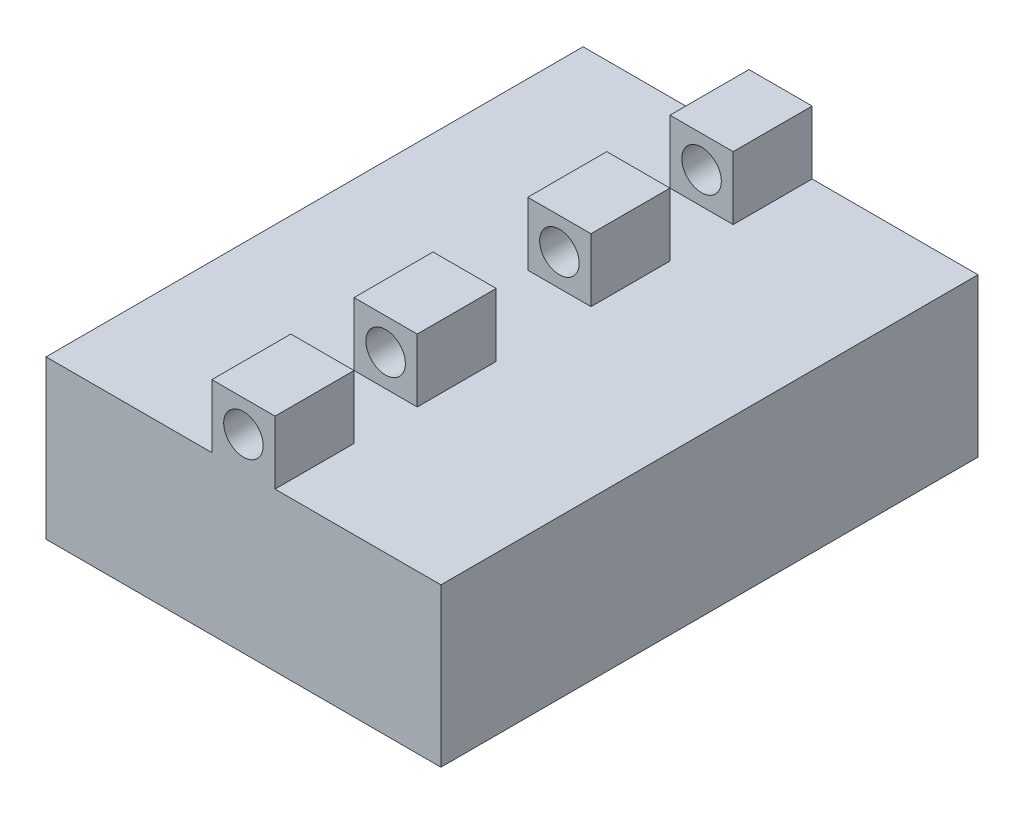
ISO-10303-21;
HEADER;
FILE_DESCRIPTION(('STEP AP214'),'2;1');
FILE_NAME('part.step','',(''),(''),'','','');
FILE_SCHEMA(('AUTOMOTIVE_DESIGN { 1 0 10303 214 1 1 1 1 }'));
ENDSEC;
DATA;
#1=APPLICATION_CONTEXT('core data for automotive mechanical design processes');
#2=APPLICATION_PROTOCOL_DEFINITION('international standard','automotive_design',2000,#1);
#3=PRODUCT_CONTEXT('',#1,'mechanical');
#4=PRODUCT('Part','Part','',(#3));
#5=PRODUCT_RELATED_PRODUCT_CATEGORY('part','',(#4));
#6=PRODUCT_DEFINITION_FORMATION('','',#4);
#7=PRODUCT_DEFINITION_CONTEXT('part definition',#1,'design');
#8=PRODUCT_DEFINITION('design','',#6,#7);
#9=PRODUCT_DEFINITION_SHAPE('','',#8);
#10=(LENGTH_UNIT() NAMED_UNIT(*) SI_UNIT(.MILLI.,.METRE.));
#11=(NAMED_UNIT(*) PLANE_ANGLE_UNIT() SI_UNIT($,.RADIAN.));
#12=(NAMED_UNIT(*) SI_UNIT($,.STERADIAN.) SOLID_ANGLE_UNIT());
#13=UNCERTAINTY_MEASURE_WITH_UNIT(LENGTH_MEASURE(1.E-05),#10,'distance_accuracy_value','');
#14=(GEOMETRIC_REPRESENTATION_CONTEXT(3) GLOBAL_UNCERTAINTY_ASSIGNED_CONTEXT((#13)) GLOBAL_UNIT_ASSIGNED_CONTEXT((#10,
#11,#12)) REPRESENTATION_CONTEXT('',''));
#15=CARTESIAN_POINT('',(0.,0.,0.));
#16=DIRECTION('',(0.,0.,1.));
#17=DIRECTION('',(1.,0.,0.));
#18=AXIS2_PLACEMENT_3D('',#15,#16,#17);
#19=CARTESIAN_POINT('',(145.,120.,0.));
#20=DIRECTION('',(1.,0.,0.));
#21=DIRECTION('',(0.,0.,-1.));
#22=AXIS2_PLACEMENT_3D('',#19,#20,#21);
#23=PLANE('',#22);
#24=DIRECTION('',(0.,1.,0.));
#25=VECTOR('',#24,1.);
#26=CARTESIAN_POINT('',(145.,100.,250.));
#27=LINE('',#26,#25);
#28=CARTESIAN_POINT('',(145.,100.,250.));
#29=VERTEX_POINT('',#28);
#30=CARTESIAN_POINT('',(145.,140.,250.));
#31=VERTEX_POINT('',#30);
#32=EDGE_CURVE('E343',#29,#31,#27,.T.);
#33=ORIENTED_EDGE('',*,*,#32,.F.);
#34=DIRECTION('',(0.,0.,1.));
#35=VECTOR('',#34,1.);
#36=CARTESIAN_POINT('',(145.,100.,0.));
#37=LINE('',#36,#35);
#38=CARTESIAN_POINT('',(145.,100.,200.));
#39=VERTEX_POINT('',#38);
#40=EDGE_CURVE('E223',#39,#29,#37,.T.);
#41=ORIENTED_EDGE('',*,*,#40,.F.);
#42=DIRECTION('',(0.,1.,0.));
#43=VECTOR('',#42,1.);
#44=CARTESIAN_POINT('',(145.,100.,200.));
#45=LINE('',#44,#43);
#46=CARTESIAN_POINT('',(145.,140.,200.));
#47=VERTEX_POINT('',#46);
#48=EDGE_CURVE('E250',#39,#47,#45,.T.);
#49=ORIENTED_EDGE('',*,*,#48,.T.);
#50=DIRECTION('',(0.,0.,1.));
#51=VECTOR('',#50,1.);
#52=CARTESIAN_POINT('',(145.,140.,0.));
#53=LINE('',#52,#51);
#54=EDGE_CURVE('E344',#47,#31,#53,.T.);
#55=ORIENTED_EDGE('',*,*,#54,.T.);
#56=EDGE_LOOP('',(#33,#41,#49,#55));
#57=FACE_BOUND('',#56,.T.);
#58=ADVANCED_FACE('F39',(#57),#23,.T.);
#59=DIRECTION('',(0.,1.,0.));
#60=VECTOR('',#59,1.);
#61=CARTESIAN_POINT('',(145.,100.,140.));
#62=LINE('',#61,#60);
#63=CARTESIAN_POINT('',(145.,100.,140.));
#64=VERTEX_POINT('',#63);
#65=CARTESIAN_POINT('',(145.,140.,140.));
#66=VERTEX_POINT('',#65);
#67=EDGE_CURVE('E265',#64,#66,#62,.T.);
#68=ORIENTED_EDGE('',*,*,#67,.F.);
#69=CARTESIAN_POINT('',(145.,100.,90.));
#70=VERTEX_POINT('',#69);
#71=EDGE_CURVE('E242',#70,#64,#37,.T.);
#72=ORIENTED_EDGE('',*,*,#71,.F.);
#73=DIRECTION('',(0.,1.,0.));
#74=VECTOR('',#73,1.);
#75=CARTESIAN_POINT('',(145.,100.,90.));
#76=LINE('',#75,#74);
#77=CARTESIAN_POINT('',(145.,140.,90.));
#78=VERTEX_POINT('',#77);
#79=EDGE_CURVE('E288',#70,#78,#76,.T.);
#80=ORIENTED_EDGE('',*,*,#79,.T.);
#81=EDGE_CURVE('E373',#78,#66,#53,.T.);
#82=ORIENTED_EDGE('',*,*,#81,.T.);
#83=EDGE_LOOP('',(#68,#72,#80,#82));
#84=FACE_BOUND('',#83,.T.);
#85=ADVANCED_FACE('F386',(#84),#23,.T.);
#86=DIRECTION('',(0.,1.,0.));
#87=VECTOR('',#86,1.);
#88=CARTESIAN_POINT('',(145.,100.,50.));
#89=LINE('',#88,#87);
#90=CARTESIAN_POINT('',(145.,100.,50.));
#91=VERTEX_POINT('',#90);
#92=CARTESIAN_POINT('',(145.,140.,50.));
#93=VERTEX_POINT('',#92);
#94=EDGE_CURVE('E285',#91,#93,#89,.T.);
#95=ORIENTED_EDGE('',*,*,#94,.F.);
#96=CARTESIAN_POINT('',(145.,100.,0.));
#97=VERTEX_POINT('',#96);
#98=EDGE_CURVE('E224',#97,#91,#37,.T.);
#99=ORIENTED_EDGE('',*,*,#98,.F.);
#100=DIRECTION('',(0.,1.,0.));
#101=VECTOR('',#100,1.);
#102=CARTESIAN_POINT('',(145.,132.5,0.));
#103=LINE('',#102,#101);
#104=CARTESIAN_POINT('',(145.,140.,0.));
#105=VERTEX_POINT('',#104);
#106=EDGE_CURVE('E303',#97,#105,#103,.T.);
#107=ORIENTED_EDGE('',*,*,#106,.T.);
#108=EDGE_CURVE('E371',#105,#93,#53,.T.);
#109=ORIENTED_EDGE('',*,*,#108,.T.);
#110=EDGE_LOOP('',(#95,#99,#107,#109));
#111=FACE_BOUND('',#110,.T.);
#112=ADVANCED_FACE('F468',(#111),#23,.T.);
#113=CARTESIAN_POINT('',(105.,120.,0.));
#114=DIRECTION('',(-1.,0.,0.));
#115=DIRECTION('',(0.,0.,1.));
#116=AXIS2_PLACEMENT_3D('',#113,#114,#115);
#117=PLANE('',#116);
#118=DIRECTION('',(0.,1.,0.));
#119=VECTOR('',#118,1.);
#120=CARTESIAN_POINT('',(105.,100.,250.));
#121=LINE('',#120,#119);
#122=CARTESIAN_POINT('',(105.,100.,250.));
#123=VERTEX_POINT('',#122);
#124=CARTESIAN_POINT('',(105.,140.,250.));
#125=VERTEX_POINT('',#124);
#126=EDGE_CURVE('E348',#123,#125,#121,.T.);
#127=ORIENTED_EDGE('',*,*,#126,.T.);
#128=DIRECTION('',(0.,0.,1.));
#129=VECTOR('',#128,1.);
#130=CARTESIAN_POINT('',(105.,140.,0.));
#131=LINE('',#130,#129);
#132=CARTESIAN_POINT('',(105.,140.,200.));
#133=VERTEX_POINT('',#132);
#134=EDGE_CURVE('E382',#133,#125,#131,.T.);
#135=ORIENTED_EDGE('',*,*,#134,.F.);
#136=DIRECTION('',(0.,1.,0.));
#137=VECTOR('',#136,1.);
#138=CARTESIAN_POINT('',(105.,100.,200.));
#139=LINE('',#138,#137);
#140=CARTESIAN_POINT('',(105.,100.,200.));
#141=VERTEX_POINT('',#140);
#142=EDGE_CURVE('E65',#141,#133,#139,.T.);
#143=ORIENTED_EDGE('',*,*,#142,.F.);
#144=DIRECTION('',(0.,0.,1.));
#145=VECTOR('',#144,1.);
#146=CARTESIAN_POINT('',(105.,100.,0.));
#147=LINE('',#146,#145);
#148=EDGE_CURVE('E204',#141,#123,#147,.T.);
#149=ORIENTED_EDGE('',*,*,#148,.T.);
#150=EDGE_LOOP('',(#127,#135,#143,#149));
#151=FACE_BOUND('',#150,.T.);
#152=ADVANCED_FACE('F502',(#151),#117,.T.);
#153=DIRECTION('',(0.,1.,0.));
#154=VECTOR('',#153,1.);
#155=CARTESIAN_POINT('',(105.,100.,140.));
#156=LINE('',#155,#154);
#157=CARTESIAN_POINT('',(105.,100.,140.));
#158=VERTEX_POINT('',#157);
#159=CARTESIAN_POINT('',(105.,140.,140.));
#160=VERTEX_POINT('',#159);
#161=EDGE_CURVE('E232',#158,#160,#156,.T.);
#162=ORIENTED_EDGE('',*,*,#161,.T.);
#163=CARTESIAN_POINT('',(105.,140.,90.));
#164=VERTEX_POINT('',#163);
#165=EDGE_CURVE('E213',#164,#160,#131,.T.);
#166=ORIENTED_EDGE('',*,*,#165,.F.);
#167=DIRECTION('',(0.,1.,0.));
#168=VECTOR('',#167,1.);
#169=CARTESIAN_POINT('',(105.,100.,90.));
#170=LINE('',#169,#168);
#171=CARTESIAN_POINT('',(105.,100.,90.));
#172=VERTEX_POINT('',#171);
#173=EDGE_CURVE('E234',#172,#164,#170,.T.);
#174=ORIENTED_EDGE('',*,*,#173,.F.);
#175=EDGE_CURVE('E211',#172,#158,#147,.T.);
#176=ORIENTED_EDGE('',*,*,#175,.T.);
#177=EDGE_LOOP('',(#162,#166,#174,#176));
#178=FACE_BOUND('',#177,.T.);
#179=ADVANCED_FACE('F230',(#178),#117,.T.);
#180=DIRECTION('',(0.,1.,0.));
#181=VECTOR('',#180,1.);
#182=CARTESIAN_POINT('',(105.,100.,50.));
#183=LINE('',#182,#181);
#184=CARTESIAN_POINT('',(105.,100.,50.));
#185=VERTEX_POINT('',#184);
#186=CARTESIAN_POINT('',(105.,140.,50.));
#187=VERTEX_POINT('',#186);
#188=EDGE_CURVE('E259',#185,#187,#183,.T.);
#189=ORIENTED_EDGE('',*,*,#188,.T.);
#190=CARTESIAN_POINT('',(105.,140.,0.));
#191=VERTEX_POINT('',#190);
#192=EDGE_CURVE('E205',#191,#187,#131,.T.);
#193=ORIENTED_EDGE('',*,*,#192,.F.);
#194=DIRECTION('',(0.,-1.,0.));
#195=VECTOR('',#194,1.);
#196=CARTESIAN_POINT('',(105.,140.,0.));
#197=LINE('',#196,#195);
#198=CARTESIAN_POINT('',(105.,100.,0.));
#199=VERTEX_POINT('',#198);
#200=EDGE_CURVE('E311',#191,#199,#197,.T.);
#201=ORIENTED_EDGE('',*,*,#200,.T.);
#202=EDGE_CURVE('E207',#199,#185,#147,.T.);
#203=ORIENTED_EDGE('',*,*,#202,.T.);
#204=EDGE_LOOP('',(#189,#193,#201,#203));
#205=FACE_BOUND('',#204,.T.);
#206=ADVANCED_FACE('F475',(#205),#117,.T.);
#207=CARTESIAN_POINT('',(145.,140.,0.));
#208=DIRECTION('',(0.,1.,0.));
#209=DIRECTION('',(0.,0.,1.));
#210=AXIS2_PLACEMENT_3D('',#207,#208,#209);
#211=PLANE('',#210);
#212=DIRECTION('',(-1.,0.,0.));
#213=VECTOR('',#212,1.);
#214=CARTESIAN_POINT('',(105.,140.,250.));
#215=LINE('',#214,#213);
#216=EDGE_CURVE('E187',#31,#125,#215,.T.);
#217=ORIENTED_EDGE('',*,*,#216,.F.);
#218=ORIENTED_EDGE('',*,*,#54,.F.);
#219=DIRECTION('',(1.,0.,0.));
#220=VECTOR('',#219,1.);
#221=CARTESIAN_POINT('',(105.,140.,200.));
#222=LINE('',#221,#220);
#223=EDGE_CURVE('E256',#133,#47,#222,.T.);
#224=ORIENTED_EDGE('',*,*,#223,.F.);
#225=ORIENTED_EDGE('',*,*,#134,.T.);
#226=EDGE_LOOP('',(#217,#218,#224,#225));
#227=FACE_BOUND('',#226,.T.);
#228=ADVANCED_FACE('F504',(#227),#211,.T.);
#229=DIRECTION('',(-1.,0.,0.));
#230=VECTOR('',#229,1.);
#231=CARTESIAN_POINT('',(105.,140.,140.));
#232=LINE('',#231,#230);
#233=EDGE_CURVE('E253',#66,#160,#232,.T.);
#234=ORIENTED_EDGE('',*,*,#233,.F.);
#235=ORIENTED_EDGE('',*,*,#81,.F.);
#236=DIRECTION('',(1.,0.,0.));
#237=VECTOR('',#236,1.);
#238=CARTESIAN_POINT('',(105.,140.,90.));
#239=LINE('',#238,#237);
#240=EDGE_CURVE('E278',#164,#78,#239,.T.);
#241=ORIENTED_EDGE('',*,*,#240,.F.);
#242=ORIENTED_EDGE('',*,*,#165,.T.);
#243=EDGE_LOOP('',(#234,#235,#241,#242));
#244=FACE_BOUND('',#243,.T.);
#245=ADVANCED_FACE('F390',(#244),#211,.T.);
#246=DIRECTION('',(-1.,0.,0.));
#247=VECTOR('',#246,1.);
#248=CARTESIAN_POINT('',(105.,140.,50.));
#249=LINE('',#248,#247);
#250=EDGE_CURVE('E274',#93,#187,#249,.T.);
#251=ORIENTED_EDGE('',*,*,#250,.F.);
#252=ORIENTED_EDGE('',*,*,#108,.F.);
#253=DIRECTION('',(-1.,0.,0.));
#254=VECTOR('',#253,1.);
#255=CARTESIAN_POINT('',(145.,140.,0.));
#256=LINE('',#255,#254);
#257=EDGE_CURVE('E306',#105,#191,#256,.T.);
#258=ORIENTED_EDGE('',*,*,#257,.T.);
#259=ORIENTED_EDGE('',*,*,#192,.T.);
#260=EDGE_LOOP('',(#251,#252,#258,#259));
#261=FACE_BOUND('',#260,.T.);
#262=ADVANCED_FACE('F474',(#261),#211,.T.);
#263=CARTESIAN_POINT('',(125.,120.,0.));
#264=DIRECTION('',(0.,0.,1.));
#265=DIRECTION('',(1.,0.,0.));
#266=AXIS2_PLACEMENT_3D('',#263,#264,#265);
#267=CYLINDRICAL_SURFACE('',#266,12.5);
#268=CARTESIAN_POINT('',(125.,120.,50.));
#269=DIRECTION('',(0.,0.,-1.));
#270=DIRECTION('',(-1.,0.,0.));
#271=AXIS2_PLACEMENT_3D('',#268,#269,#270);
#272=CIRCLE('',#271,12.5);
#273=CARTESIAN_POINT('',(112.5,120.,50.));
#274=VERTEX_POINT('',#273);
#275=EDGE_CURVE('E409',#274,#274,#272,.F.);
#276=ORIENTED_EDGE('',*,*,#275,.T.);
#277=EDGE_LOOP('',(#276));
#278=FACE_BOUND('',#277,.T.);
#279=CARTESIAN_POINT('',(125.,120.,0.));
#280=DIRECTION('',(0.,0.,1.));
#281=DIRECTION('',(1.,0.,0.));
#282=AXIS2_PLACEMENT_3D('',#279,#280,#281);
#283=CIRCLE('',#282,12.5);
#284=CARTESIAN_POINT('',(137.5,120.,0.));
#285=VERTEX_POINT('',#284);
#286=EDGE_CURVE('E294',#285,#285,#283,.T.);
#287=ORIENTED_EDGE('',*,*,#286,.F.);
#288=EDGE_LOOP('',(#287));
#289=FACE_BOUND('',#288,.T.);
#290=ADVANCED_FACE('F510',(#278,#289),#267,.F.);
#291=CARTESIAN_POINT('',(0.,100.,0.));
#292=DIRECTION('',(1.,0.,0.));
#293=DIRECTION('',(0.,0.,-1.));
#294=AXIS2_PLACEMENT_3D('',#291,#292,#293);
#295=PLANE('',#294);
#296=DIRECTION('',(0.,0.,1.));
#297=VECTOR('',#296,1.);
#298=CARTESIAN_POINT('',(0.,0.,0.));
#299=LINE('',#298,#297);
#300=CARTESIAN_POINT('',(0.,0.,0.));
#301=VERTEX_POINT('',#300);
#302=CARTESIAN_POINT('',(0.,0.,340.));
#303=VERTEX_POINT('',#302);
#304=EDGE_CURVE('E325',#301,#303,#299,.T.);
#305=ORIENTED_EDGE('',*,*,#304,.T.);
#306=DIRECTION('',(0.,-1.,0.));
#307=VECTOR('',#306,1.);
#308=CARTESIAN_POINT('',(0.,100.,340.));
#309=LINE('',#308,#307);
#310=CARTESIAN_POINT('',(0.,100.,340.));
#311=VERTEX_POINT('',#310);
#312=EDGE_CURVE('E11',#311,#303,#309,.T.);
#313=ORIENTED_EDGE('',*,*,#312,.F.);
#314=DIRECTION('',(0.,0.,1.));
#315=VECTOR('',#314,1.);
#316=CARTESIAN_POINT('',(0.,100.,0.));
#317=LINE('',#316,#315);
#318=CARTESIAN_POINT('',(0.,100.,0.));
#319=VERTEX_POINT('',#318);
#320=EDGE_CURVE('E433',#319,#311,#317,.T.);
#321=ORIENTED_EDGE('',*,*,#320,.F.);
#322=DIRECTION('',(0.,-1.,0.));
#323=VECTOR('',#322,1.);
#324=CARTESIAN_POINT('',(0.,100.,0.));
#325=LINE('',#324,#323);
#326=EDGE_CURVE('E425',#319,#301,#325,.T.);
#327=ORIENTED_EDGE('',*,*,#326,.T.);
#328=EDGE_LOOP('',(#305,#313,#321,#327));
#329=FACE_BOUND('',#328,.T.);
#330=ADVANCED_FACE('F41',(#329),#295,.F.);
#331=CARTESIAN_POINT('',(0.,100.,340.));
#332=DIRECTION('',(0.,0.,-1.));
#333=DIRECTION('',(-1.,0.,0.));
#334=AXIS2_PLACEMENT_3D('',#331,#332,#333);
#335=PLANE('',#334);
#336=DIRECTION('',(1.,0.,0.));
#337=VECTOR('',#336,1.);
#338=CARTESIAN_POINT('',(0.,0.,340.));
#339=LINE('',#338,#337);
#340=CARTESIAN_POINT('',(250.,0.,340.));
#341=VERTEX_POINT('',#340);
#342=EDGE_CURVE('E331',#303,#341,#339,.T.);
#343=ORIENTED_EDGE('',*,*,#342,.T.);
#344=DIRECTION('',(0.,-1.,0.));
#345=VECTOR('',#344,1.);
#346=CARTESIAN_POINT('',(250.,100.,340.));
#347=LINE('',#346,#345);
#348=CARTESIAN_POINT('',(250.,100.,340.));
#349=VERTEX_POINT('',#348);
#350=EDGE_CURVE('E49',#349,#341,#347,.T.);
#351=ORIENTED_EDGE('',*,*,#350,.F.);
#352=DIRECTION('',(1.,0.,0.));
#353=VECTOR('',#352,1.);
#354=CARTESIAN_POINT('',(0.,100.,340.));
#355=LINE('',#354,#353);
#356=CARTESIAN_POINT('',(145.,100.,340.));
#357=VERTEX_POINT('',#356);
#358=EDGE_CURVE('E446',#357,#349,#355,.T.);
#359=ORIENTED_EDGE('',*,*,#358,.F.);
#360=DIRECTION('',(0.,1.,0.));
#361=VECTOR('',#360,1.);
#362=CARTESIAN_POINT('',(145.,120.,340.));
#363=LINE('',#362,#361);
#364=CARTESIAN_POINT('',(145.,140.,340.));
#365=VERTEX_POINT('',#364);
#366=EDGE_CURVE('E307',#357,#365,#363,.T.);
#367=ORIENTED_EDGE('',*,*,#366,.T.);
#368=DIRECTION('',(-1.,0.,0.));
#369=VECTOR('',#368,1.);
#370=CARTESIAN_POINT('',(145.,140.,340.));
#371=LINE('',#370,#369);
#372=CARTESIAN_POINT('',(105.,140.,340.));
#373=VERTEX_POINT('',#372);
#374=EDGE_CURVE('E298',#365,#373,#371,.T.);
#375=ORIENTED_EDGE('',*,*,#374,.T.);
#376=DIRECTION('',(0.,-1.,0.));
#377=VECTOR('',#376,1.);
#378=CARTESIAN_POINT('',(105.,120.,340.));
#379=LINE('',#378,#377);
#380=CARTESIAN_POINT('',(105.,100.,340.));
#381=VERTEX_POINT('',#380);
#382=EDGE_CURVE('E318',#373,#381,#379,.T.);
#383=ORIENTED_EDGE('',*,*,#382,.T.);
#384=EDGE_CURVE('E202',#311,#381,#355,.T.);
#385=ORIENTED_EDGE('',*,*,#384,.F.);
#386=ORIENTED_EDGE('',*,*,#312,.T.);
#387=EDGE_LOOP('',(#343,#351,#359,#367,#375,#383,#385,#386));
#388=FACE_BOUND('',#387,.T.);
#389=CARTESIAN_POINT('',(125.,120.,340.));
#390=DIRECTION('',(0.,0.,1.));
#391=DIRECTION('',(1.,0.,0.));
#392=AXIS2_PLACEMENT_3D('',#389,#390,#391);
#393=CIRCLE('',#392,12.5);
#394=CARTESIAN_POINT('',(137.5,120.,340.));
#395=VERTEX_POINT('',#394);
#396=EDGE_CURVE('E299',#395,#395,#393,.T.);
#397=ORIENTED_EDGE('',*,*,#396,.F.);
#398=EDGE_LOOP('',(#397));
#399=FACE_BOUND('',#398,.T.);
#400=ADVANCED_FACE('F456',(#388,#399),#335,.F.);
#401=CARTESIAN_POINT('',(250.,100.,0.));
#402=DIRECTION('',(-1.,0.,0.));
#403=DIRECTION('',(0.,0.,1.));
#404=AXIS2_PLACEMENT_3D('',#401,#402,#403);
#405=PLANE('',#404);
#406=DIRECTION('',(0.,0.,-1.));
#407=VECTOR('',#406,1.);
#408=CARTESIAN_POINT('',(250.,0.,0.));
#409=LINE('',#408,#407);
#410=CARTESIAN_POINT('',(250.,0.,0.));
#411=VERTEX_POINT('',#410);
#412=EDGE_CURVE('E434',#341,#411,#409,.T.);
#413=ORIENTED_EDGE('',*,*,#412,.T.);
#414=DIRECTION('',(0.,-1.,0.));
#415=VECTOR('',#414,1.);
#416=CARTESIAN_POINT('',(250.,100.,0.));
#417=LINE('',#416,#415);
#418=CARTESIAN_POINT('',(250.,100.,0.));
#419=VERTEX_POINT('',#418);
#420=EDGE_CURVE('E421',#419,#411,#417,.T.);
#421=ORIENTED_EDGE('',*,*,#420,.F.);
#422=DIRECTION('',(0.,0.,-1.));
#423=VECTOR('',#422,1.);
#424=CARTESIAN_POINT('',(250.,100.,0.));
#425=LINE('',#424,#423);
#426=EDGE_CURVE('E442',#349,#419,#425,.T.);
#427=ORIENTED_EDGE('',*,*,#426,.F.);
#428=ORIENTED_EDGE('',*,*,#350,.T.);
#429=EDGE_LOOP('',(#413,#421,#427,#428));
#430=FACE_BOUND('',#429,.T.);
#431=ADVANCED_FACE('F460',(#430),#405,.F.);
#432=CARTESIAN_POINT('',(0.,100.,0.));
#433=DIRECTION('',(0.,0.,1.));
#434=DIRECTION('',(1.,0.,0.));
#435=AXIS2_PLACEMENT_3D('',#432,#433,#434);
#436=PLANE('',#435);
#437=DIRECTION('',(-1.,0.,0.));
#438=VECTOR('',#437,1.);
#439=CARTESIAN_POINT('',(0.,0.,0.));
#440=LINE('',#439,#438);
#441=EDGE_CURVE('E430',#411,#301,#440,.T.);
#442=ORIENTED_EDGE('',*,*,#441,.T.);
#443=ORIENTED_EDGE('',*,*,#326,.F.);
#444=DIRECTION('',(-1.,0.,0.));
#445=VECTOR('',#444,1.);
#446=CARTESIAN_POINT('',(0.,100.,0.));
#447=LINE('',#446,#445);
#448=EDGE_CURVE('E441',#199,#319,#447,.T.);
#449=ORIENTED_EDGE('',*,*,#448,.F.);
#450=ORIENTED_EDGE('',*,*,#200,.F.);
#451=ORIENTED_EDGE('',*,*,#257,.F.);
#452=ORIENTED_EDGE('',*,*,#106,.F.);
#453=EDGE_CURVE('E429',#419,#97,#447,.T.);
#454=ORIENTED_EDGE('',*,*,#453,.F.);
#455=ORIENTED_EDGE('',*,*,#420,.T.);
#456=EDGE_LOOP('',(#442,#443,#449,#450,#451,#452,#454,#455));
#457=FACE_BOUND('',#456,.T.);
#458=ORIENTED_EDGE('',*,*,#286,.T.);
#459=EDGE_LOOP('',(#458));
#460=FACE_BOUND('',#459,.T.);
#461=ADVANCED_FACE('F464',(#457,#460),#436,.F.);
#462=CARTESIAN_POINT('',(0.,100.,0.));
#463=DIRECTION('',(0.,1.,0.));
#464=DIRECTION('',(0.,0.,1.));
#465=AXIS2_PLACEMENT_3D('',#462,#463,#464);
#466=PLANE('',#465);
#467=ORIENTED_EDGE('',*,*,#40,.T.);
#468=DIRECTION('',(-1.,0.,0.));
#469=VECTOR('',#468,1.);
#470=CARTESIAN_POINT('',(105.,100.,250.));
#471=LINE('',#470,#469);
#472=EDGE_CURVE('E186',#29,#123,#471,.T.);
#473=ORIENTED_EDGE('',*,*,#472,.T.);
#474=ORIENTED_EDGE('',*,*,#148,.F.);
#475=DIRECTION('',(1.,0.,0.));
#476=VECTOR('',#475,1.);
#477=CARTESIAN_POINT('',(105.,100.,200.));
#478=LINE('',#477,#476);
#479=EDGE_CURVE('E246',#141,#39,#478,.T.);
#480=ORIENTED_EDGE('',*,*,#479,.T.);
#481=EDGE_LOOP('',(#467,#473,#474,#480));
#482=FACE_BOUND('',#481,.T.);
#483=ORIENTED_EDGE('',*,*,#71,.T.);
#484=DIRECTION('',(-1.,0.,0.));
#485=VECTOR('',#484,1.);
#486=CARTESIAN_POINT('',(105.,100.,140.));
#487=LINE('',#486,#485);
#488=EDGE_CURVE('E241',#64,#158,#487,.T.);
#489=ORIENTED_EDGE('',*,*,#488,.T.);
#490=ORIENTED_EDGE('',*,*,#175,.F.);
#491=DIRECTION('',(1.,0.,0.));
#492=VECTOR('',#491,1.);
#493=CARTESIAN_POINT('',(105.,100.,90.));
#494=LINE('',#493,#492);
#495=EDGE_CURVE('E239',#172,#70,#494,.T.);
#496=ORIENTED_EDGE('',*,*,#495,.T.);
#497=EDGE_LOOP('',(#483,#489,#490,#496));
#498=FACE_BOUND('',#497,.T.);
#499=ORIENTED_EDGE('',*,*,#202,.F.);
#500=ORIENTED_EDGE('',*,*,#448,.T.);
#501=ORIENTED_EDGE('',*,*,#320,.T.);
#502=ORIENTED_EDGE('',*,*,#384,.T.);
#503=CARTESIAN_POINT('',(105.,100.,290.));
#504=VERTEX_POINT('',#503);
#505=EDGE_CURVE('E193',#504,#381,#147,.T.);
#506=ORIENTED_EDGE('',*,*,#505,.F.);
#507=DIRECTION('',(1.,0.,0.));
#508=VECTOR('',#507,1.);
#509=CARTESIAN_POINT('',(105.,100.,290.));
#510=LINE('',#509,#508);
#511=CARTESIAN_POINT('',(145.,100.,290.));
#512=VERTEX_POINT('',#511);
#513=EDGE_CURVE('E177',#504,#512,#510,.T.);
#514=ORIENTED_EDGE('',*,*,#513,.T.);
#515=EDGE_CURVE('E218',#512,#357,#37,.T.);
#516=ORIENTED_EDGE('',*,*,#515,.T.);
#517=ORIENTED_EDGE('',*,*,#358,.T.);
#518=ORIENTED_EDGE('',*,*,#426,.T.);
#519=ORIENTED_EDGE('',*,*,#453,.T.);
#520=ORIENTED_EDGE('',*,*,#98,.T.);
#521=DIRECTION('',(-1.,0.,0.));
#522=VECTOR('',#521,1.);
#523=CARTESIAN_POINT('',(105.,100.,50.));
#524=LINE('',#523,#522);
#525=EDGE_CURVE('E273',#91,#185,#524,.T.);
#526=ORIENTED_EDGE('',*,*,#525,.T.);
#527=EDGE_LOOP('',(#499,#500,#501,#502,#506,#514,#516,#517,#518,#519,#520,#526));
#528=FACE_BOUND('',#527,.T.);
#529=ADVANCED_FACE('F200',(#482,#498,#528),#466,.T.);
#530=CARTESIAN_POINT('',(0.,0.,0.));
#531=DIRECTION('',(0.,1.,0.));
#532=DIRECTION('',(0.,0.,1.));
#533=AXIS2_PLACEMENT_3D('',#530,#531,#532);
#534=PLANE('',#533);
#535=ORIENTED_EDGE('',*,*,#304,.F.);
#536=ORIENTED_EDGE('',*,*,#441,.F.);
#537=ORIENTED_EDGE('',*,*,#412,.F.);
#538=ORIENTED_EDGE('',*,*,#342,.F.);
#539=EDGE_LOOP('',(#535,#536,#537,#538));
#540=FACE_BOUND('',#539,.T.);
#541=ADVANCED_FACE('F482',(#540),#534,.F.);
#542=DIRECTION('',(0.,1.,0.));
#543=VECTOR('',#542,1.);
#544=CARTESIAN_POINT('',(145.,100.,290.));
#545=LINE('',#544,#543);
#546=CARTESIAN_POINT('',(145.,140.,290.));
#547=VERTEX_POINT('',#546);
#548=EDGE_CURVE('E181',#512,#547,#545,.T.);
#549=ORIENTED_EDGE('',*,*,#548,.T.);
#550=EDGE_CURVE('E314',#547,#365,#53,.T.);
#551=ORIENTED_EDGE('',*,*,#550,.T.);
#552=ORIENTED_EDGE('',*,*,#366,.F.);
#553=ORIENTED_EDGE('',*,*,#515,.F.);
#554=EDGE_LOOP('',(#549,#551,#552,#553));
#555=FACE_BOUND('',#554,.T.);
#556=ADVANCED_FACE('F365',(#555),#23,.T.);
#557=DIRECTION('',(0.,1.,0.));
#558=VECTOR('',#557,1.);
#559=CARTESIAN_POINT('',(105.,100.,290.));
#560=LINE('',#559,#558);
#561=CARTESIAN_POINT('',(105.,140.,290.));
#562=VERTEX_POINT('',#561);
#563=EDGE_CURVE('E57',#504,#562,#560,.T.);
#564=ORIENTED_EDGE('',*,*,#563,.F.);
#565=ORIENTED_EDGE('',*,*,#505,.T.);
#566=ORIENTED_EDGE('',*,*,#382,.F.);
#567=EDGE_CURVE('E195',#562,#373,#131,.T.);
#568=ORIENTED_EDGE('',*,*,#567,.F.);
#569=EDGE_LOOP('',(#564,#565,#566,#568));
#570=FACE_BOUND('',#569,.T.);
#571=ADVANCED_FACE('F191',(#570),#117,.T.);
#572=DIRECTION('',(1.,0.,0.));
#573=VECTOR('',#572,1.);
#574=CARTESIAN_POINT('',(105.,140.,290.));
#575=LINE('',#574,#573);
#576=EDGE_CURVE('E264',#562,#547,#575,.T.);
#577=ORIENTED_EDGE('',*,*,#576,.F.);
#578=ORIENTED_EDGE('',*,*,#567,.T.);
#579=ORIENTED_EDGE('',*,*,#374,.F.);
#580=ORIENTED_EDGE('',*,*,#550,.F.);
#581=EDGE_LOOP('',(#577,#578,#579,#580));
#582=FACE_BOUND('',#581,.T.);
#583=ADVANCED_FACE('F368',(#582),#211,.T.);
#584=CARTESIAN_POINT('',(125.,120.,290.));
#585=DIRECTION('',(0.,0.,1.));
#586=DIRECTION('',(1.,0.,0.));
#587=AXIS2_PLACEMENT_3D('',#584,#585,#586);
#588=CIRCLE('',#587,12.5);
#589=CARTESIAN_POINT('',(137.5,120.,290.));
#590=VERTEX_POINT('',#589);
#591=EDGE_CURVE('E402',#590,#590,#588,.F.);
#592=ORIENTED_EDGE('',*,*,#591,.T.);
#593=EDGE_LOOP('',(#592));
#594=FACE_BOUND('',#593,.T.);
#595=ORIENTED_EDGE('',*,*,#396,.T.);
#596=EDGE_LOOP('',(#595));
#597=FACE_BOUND('',#596,.T.);
#598=ADVANCED_FACE('F498',(#594,#597),#267,.F.);
#599=CARTESIAN_POINT('',(105.,100.,50.));
#600=DIRECTION('',(0.,0.,-1.));
#601=DIRECTION('',(-1.,0.,0.));
#602=AXIS2_PLACEMENT_3D('',#599,#600,#601);
#603=PLANE('',#602);
#604=ORIENTED_EDGE('',*,*,#250,.T.);
#605=ORIENTED_EDGE('',*,*,#188,.F.);
#606=ORIENTED_EDGE('',*,*,#525,.F.);
#607=ORIENTED_EDGE('',*,*,#94,.T.);
#608=EDGE_LOOP('',(#604,#605,#606,#607));
#609=FACE_BOUND('',#608,.T.);
#610=ORIENTED_EDGE('',*,*,#275,.F.);
#611=EDGE_LOOP('',(#610));
#612=FACE_BOUND('',#611,.T.);
#613=ADVANCED_FACE('F471',(#609,#612),#603,.F.);
#614=CARTESIAN_POINT('',(105.,100.,90.));
#615=DIRECTION('',(0.,0.,1.));
#616=DIRECTION('',(1.,0.,0.));
#617=AXIS2_PLACEMENT_3D('',#614,#615,#616);
#618=PLANE('',#617);
#619=ORIENTED_EDGE('',*,*,#240,.T.);
#620=ORIENTED_EDGE('',*,*,#79,.F.);
#621=ORIENTED_EDGE('',*,*,#495,.F.);
#622=ORIENTED_EDGE('',*,*,#173,.T.);
#623=EDGE_LOOP('',(#619,#620,#621,#622));
#624=FACE_BOUND('',#623,.T.);
#625=CARTESIAN_POINT('',(125.,120.,90.));
#626=DIRECTION('',(0.,0.,1.));
#627=DIRECTION('',(1.,0.,0.));
#628=AXIS2_PLACEMENT_3D('',#625,#626,#627);
#629=CIRCLE('',#628,12.5);
#630=CARTESIAN_POINT('',(137.5,120.,90.));
#631=VERTEX_POINT('',#630);
#632=EDGE_CURVE('E353',#631,#631,#629,.F.);
#633=ORIENTED_EDGE('',*,*,#632,.F.);
#634=EDGE_LOOP('',(#633));
#635=FACE_BOUND('',#634,.T.);
#636=ADVANCED_FACE('F395',(#624,#635),#618,.F.);
#637=CARTESIAN_POINT('',(105.,100.,140.));
#638=DIRECTION('',(0.,0.,-1.));
#639=DIRECTION('',(-1.,0.,0.));
#640=AXIS2_PLACEMENT_3D('',#637,#638,#639);
#641=PLANE('',#640);
#642=ORIENTED_EDGE('',*,*,#233,.T.);
#643=ORIENTED_EDGE('',*,*,#161,.F.);
#644=ORIENTED_EDGE('',*,*,#488,.F.);
#645=ORIENTED_EDGE('',*,*,#67,.T.);
#646=EDGE_LOOP('',(#642,#643,#644,#645));
#647=FACE_BOUND('',#646,.T.);
#648=CARTESIAN_POINT('',(125.,120.,140.));
#649=DIRECTION('',(0.,0.,-1.));
#650=DIRECTION('',(-1.,0.,0.));
#651=AXIS2_PLACEMENT_3D('',#648,#649,#650);
#652=CIRCLE('',#651,12.5);
#653=CARTESIAN_POINT('',(112.5,120.,140.));
#654=VERTEX_POINT('',#653);
#655=EDGE_CURVE('E399',#654,#654,#652,.F.);
#656=ORIENTED_EDGE('',*,*,#655,.F.);
#657=EDGE_LOOP('',(#656));
#658=FACE_BOUND('',#657,.T.);
#659=ADVANCED_FACE('F391',(#647,#658),#641,.F.);
#660=CARTESIAN_POINT('',(105.,100.,200.));
#661=DIRECTION('',(0.,0.,1.));
#662=DIRECTION('',(1.,0.,0.));
#663=AXIS2_PLACEMENT_3D('',#660,#661,#662);
#664=PLANE('',#663);
#665=ORIENTED_EDGE('',*,*,#223,.T.);
#666=ORIENTED_EDGE('',*,*,#48,.F.);
#667=ORIENTED_EDGE('',*,*,#479,.F.);
#668=ORIENTED_EDGE('',*,*,#142,.T.);
#669=EDGE_LOOP('',(#665,#666,#667,#668));
#670=FACE_BOUND('',#669,.T.);
#671=CARTESIAN_POINT('',(125.,120.,200.));
#672=DIRECTION('',(0.,0.,1.));
#673=DIRECTION('',(1.,0.,0.));
#674=AXIS2_PLACEMENT_3D('',#671,#672,#673);
#675=CIRCLE('',#674,12.5);
#676=CARTESIAN_POINT('',(137.5,120.,200.));
#677=VERTEX_POINT('',#676);
#678=EDGE_CURVE('E403',#677,#677,#675,.F.);
#679=ORIENTED_EDGE('',*,*,#678,.F.);
#680=EDGE_LOOP('',(#679));
#681=FACE_BOUND('',#680,.T.);
#682=ADVANCED_FACE('F394',(#670,#681),#664,.F.);
#683=CARTESIAN_POINT('',(105.,100.,250.));
#684=DIRECTION('',(0.,0.,-1.));
#685=DIRECTION('',(-1.,0.,0.));
#686=AXIS2_PLACEMENT_3D('',#683,#684,#685);
#687=PLANE('',#686);
#688=ORIENTED_EDGE('',*,*,#216,.T.);
#689=ORIENTED_EDGE('',*,*,#126,.F.);
#690=ORIENTED_EDGE('',*,*,#472,.F.);
#691=ORIENTED_EDGE('',*,*,#32,.T.);
#692=EDGE_LOOP('',(#688,#689,#690,#691));
#693=FACE_BOUND('',#692,.T.);
#694=CARTESIAN_POINT('',(125.,120.,250.));
#695=DIRECTION('',(0.,0.,-1.));
#696=DIRECTION('',(-1.,0.,0.));
#697=AXIS2_PLACEMENT_3D('',#694,#695,#696);
#698=CIRCLE('',#697,12.5);
#699=CARTESIAN_POINT('',(112.5,120.,250.));
#700=VERTEX_POINT('',#699);
#701=EDGE_CURVE('E43',#700,#700,#698,.F.);
#702=ORIENTED_EDGE('',*,*,#701,.F.);
#703=EDGE_LOOP('',(#702));
#704=FACE_BOUND('',#703,.T.);
#705=ADVANCED_FACE('F666',(#693,#704),#687,.F.);
#706=CARTESIAN_POINT('',(105.,100.,290.));
#707=DIRECTION('',(0.,0.,1.));
#708=DIRECTION('',(1.,0.,0.));
#709=AXIS2_PLACEMENT_3D('',#706,#707,#708);
#710=PLANE('',#709);
#711=ORIENTED_EDGE('',*,*,#576,.T.);
#712=ORIENTED_EDGE('',*,*,#548,.F.);
#713=ORIENTED_EDGE('',*,*,#513,.F.);
#714=ORIENTED_EDGE('',*,*,#563,.T.);
#715=EDGE_LOOP('',(#711,#712,#713,#714));
#716=FACE_BOUND('',#715,.T.);
#717=ORIENTED_EDGE('',*,*,#591,.F.);
#718=EDGE_LOOP('',(#717));
#719=FACE_BOUND('',#718,.T.);
#720=ADVANCED_FACE('F178',(#716,#719),#710,.F.);
#721=ORIENTED_EDGE('',*,*,#655,.T.);
#722=EDGE_LOOP('',(#721));
#723=FACE_BOUND('',#722,.T.);
#724=ORIENTED_EDGE('',*,*,#632,.T.);
#725=EDGE_LOOP('',(#724));
#726=FACE_BOUND('',#725,.T.);
#727=ADVANCED_FACE('F519',(#723,#726),#267,.F.);
#728=ORIENTED_EDGE('',*,*,#701,.T.);
#729=EDGE_LOOP('',(#728));
#730=FACE_BOUND('',#729,.T.);
#731=ORIENTED_EDGE('',*,*,#678,.T.);
#732=EDGE_LOOP('',(#731));
#733=FACE_BOUND('',#732,.T.);
#734=ADVANCED_FACE('F509',(#730,#733),#267,.F.);
#735=CLOSED_SHELL('',(#58,#85,#112,#152,#179,#206,#228,#245,#262,#290,#330,#400,#431,#461,#529,
#541,#556,#571,#583,#598,#613,#636,#659,#682,#705,#720,#727,#734));
#736=MANIFOLD_SOLID_BREP('B2',#735);
#737=ADVANCED_BREP_SHAPE_REPRESENTATION('',(#18,#736),#14);
#738=SHAPE_DEFINITION_REPRESENTATION(#9,#737);
ENDSEC;
END-ISO-10303-21;
